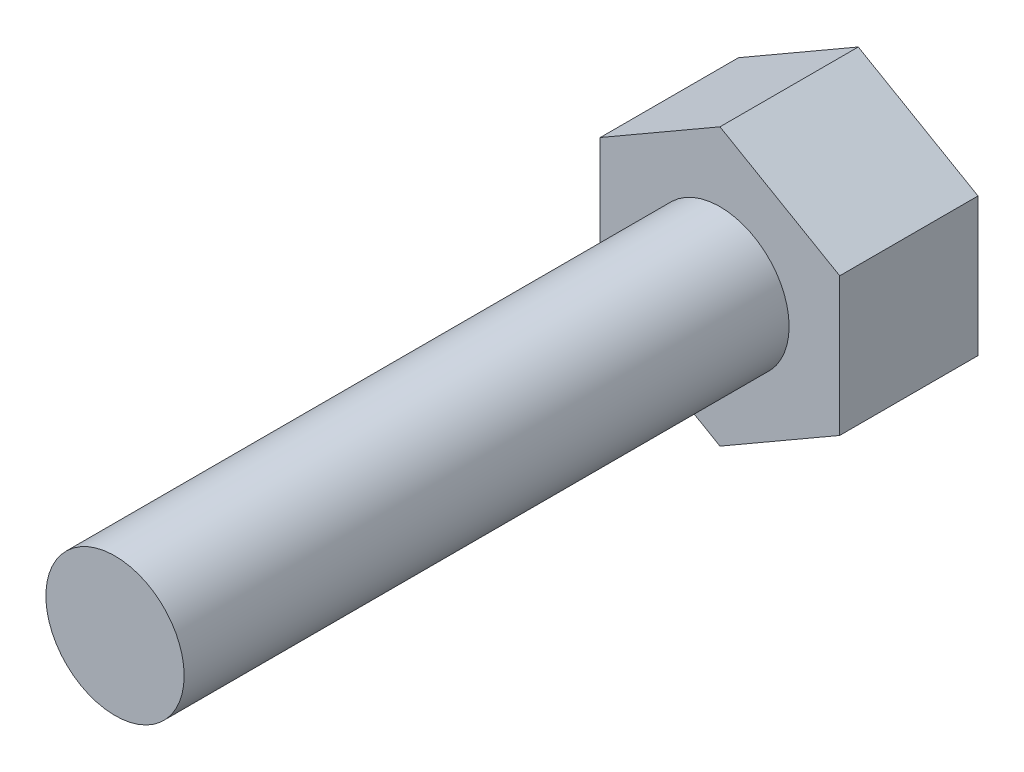
ISO-10303-21;
HEADER;
FILE_DESCRIPTION(('STEP AP214'),'2;1');
FILE_NAME('part.step','',(''),(''),'','','');
FILE_SCHEMA(('AUTOMOTIVE_DESIGN { 1 0 10303 214 1 1 1 1 }'));
ENDSEC;
DATA;
#1=APPLICATION_CONTEXT('core data for automotive mechanical design processes');
#2=APPLICATION_PROTOCOL_DEFINITION('international standard','automotive_design',2000,#1);
#3=PRODUCT_CONTEXT('',#1,'mechanical');
#4=PRODUCT('Part','Part','',(#3));
#5=PRODUCT_RELATED_PRODUCT_CATEGORY('part','',(#4));
#6=PRODUCT_DEFINITION_FORMATION('','',#4);
#7=PRODUCT_DEFINITION_CONTEXT('part definition',#1,'design');
#8=PRODUCT_DEFINITION('design','',#6,#7);
#9=PRODUCT_DEFINITION_SHAPE('','',#8);
#10=(LENGTH_UNIT() NAMED_UNIT(*) SI_UNIT(.MILLI.,.METRE.));
#11=(NAMED_UNIT(*) PLANE_ANGLE_UNIT() SI_UNIT($,.RADIAN.));
#12=(NAMED_UNIT(*) SI_UNIT($,.STERADIAN.) SOLID_ANGLE_UNIT());
#13=UNCERTAINTY_MEASURE_WITH_UNIT(LENGTH_MEASURE(1.E-05),#10,'distance_accuracy_value','');
#14=(GEOMETRIC_REPRESENTATION_CONTEXT(3) GLOBAL_UNCERTAINTY_ASSIGNED_CONTEXT((#13)) GLOBAL_UNIT_ASSIGNED_CONTEXT((#10,
#11,#12)) REPRESENTATION_CONTEXT('',''));
#15=CARTESIAN_POINT('',(0.,0.,0.));
#16=DIRECTION('',(0.,0.,1.));
#17=DIRECTION('',(1.,0.,0.));
#18=AXIS2_PLACEMENT_3D('',#15,#16,#17);
#19=CARTESIAN_POINT('',(20.7846096908264,12.0000000000002,24.));
#20=DIRECTION('',(-0.499999999999995,-0.866025403784441,0.));
#21=DIRECTION('',(0.866025403784442,-0.499999999999995,0.));
#22=AXIS2_PLACEMENT_3D('',#19,#20,#21);
#23=PLANE('',#22);
#24=DIRECTION('',(-0.866025403784442,0.499999999999995,0.));
#25=VECTOR('',#24,1.);
#26=CARTESIAN_POINT('',(20.7846096908264,12.0000000000002,0.));
#27=LINE('',#26,#25);
#28=CARTESIAN_POINT('',(20.7846096908264,12.0000000000002,0.));
#29=VERTEX_POINT('',#28);
#30=CARTESIAN_POINT('',(0.,24.,0.));
#31=VERTEX_POINT('',#30);
#32=EDGE_CURVE('E119',#29,#31,#27,.T.);
#33=ORIENTED_EDGE('',*,*,#32,.T.);
#34=DIRECTION('',(0.,0.,-1.));
#35=VECTOR('',#34,1.);
#36=CARTESIAN_POINT('',(0.,24.,24.));
#37=LINE('',#36,#35);
#38=CARTESIAN_POINT('',(0.,24.,24.));
#39=VERTEX_POINT('',#38);
#40=EDGE_CURVE('E36',#39,#31,#37,.T.);
#41=ORIENTED_EDGE('',*,*,#40,.F.);
#42=DIRECTION('',(-0.866025403784442,0.499999999999995,0.));
#43=VECTOR('',#42,1.);
#44=CARTESIAN_POINT('',(20.7846096908264,12.0000000000002,24.));
#45=LINE('',#44,#43);
#46=CARTESIAN_POINT('',(20.7846096908264,12.0000000000002,24.));
#47=VERTEX_POINT('',#46);
#48=EDGE_CURVE('E130',#47,#39,#45,.T.);
#49=ORIENTED_EDGE('',*,*,#48,.F.);
#50=DIRECTION('',(0.,0.,-1.));
#51=VECTOR('',#50,1.);
#52=CARTESIAN_POINT('',(20.7846096908264,12.0000000000002,24.));
#53=LINE('',#52,#51);
#54=EDGE_CURVE('E115',#47,#29,#53,.T.);
#55=ORIENTED_EDGE('',*,*,#54,.T.);
#56=EDGE_LOOP('',(#33,#41,#49,#55));
#57=FACE_BOUND('',#56,.T.);
#58=ADVANCED_FACE('F33',(#57),#23,.F.);
#59=CARTESIAN_POINT('',(0.,24.,24.));
#60=DIRECTION('',(0.500000000000001,-0.866025403784438,0.));
#61=DIRECTION('',(0.866025403784438,0.500000000000001,0.));
#62=AXIS2_PLACEMENT_3D('',#59,#60,#61);
#63=PLANE('',#62);
#64=DIRECTION('',(-0.866025403784438,-0.500000000000001,0.));
#65=VECTOR('',#64,1.);
#66=CARTESIAN_POINT('',(0.,24.,0.));
#67=LINE('',#66,#65);
#68=CARTESIAN_POINT('',(-20.7846096908266,12.,0.));
#69=VERTEX_POINT('',#68);
#70=EDGE_CURVE('E122',#31,#69,#67,.T.);
#71=ORIENTED_EDGE('',*,*,#70,.T.);
#72=DIRECTION('',(0.,0.,-1.));
#73=VECTOR('',#72,1.);
#74=CARTESIAN_POINT('',(-20.7846096908266,12.,24.));
#75=LINE('',#74,#73);
#76=CARTESIAN_POINT('',(-20.7846096908266,12.,24.));
#77=VERTEX_POINT('',#76);
#78=EDGE_CURVE('E133',#77,#69,#75,.T.);
#79=ORIENTED_EDGE('',*,*,#78,.F.);
#80=DIRECTION('',(-0.866025403784438,-0.500000000000001,0.));
#81=VECTOR('',#80,1.);
#82=CARTESIAN_POINT('',(0.,24.,24.));
#83=LINE('',#82,#81);
#84=EDGE_CURVE('E88',#39,#77,#83,.T.);
#85=ORIENTED_EDGE('',*,*,#84,.F.);
#86=ORIENTED_EDGE('',*,*,#40,.T.);
#87=EDGE_LOOP('',(#71,#79,#85,#86));
#88=FACE_BOUND('',#87,.T.);
#89=ADVANCED_FACE('F138',(#88),#63,.F.);
#90=CARTESIAN_POINT('',(-20.7846096908266,12.,24.));
#91=DIRECTION('',(1.,0.,0.));
#92=DIRECTION('',(0.,1.,0.));
#93=AXIS2_PLACEMENT_3D('',#90,#91,#92);
#94=PLANE('',#93);
#95=DIRECTION('',(0.,-1.,0.));
#96=VECTOR('',#95,1.);
#97=CARTESIAN_POINT('',(-20.7846096908266,12.,0.));
#98=LINE('',#97,#96);
#99=CARTESIAN_POINT('',(-20.7846096908265,-12.0000000000001,0.));
#100=VERTEX_POINT('',#99);
#101=EDGE_CURVE('E125',#69,#100,#98,.T.);
#102=ORIENTED_EDGE('',*,*,#101,.T.);
#103=DIRECTION('',(0.,0.,-1.));
#104=VECTOR('',#103,1.);
#105=CARTESIAN_POINT('',(-20.7846096908265,-12.0000000000001,24.));
#106=LINE('',#105,#104);
#107=CARTESIAN_POINT('',(-20.7846096908265,-12.0000000000001,24.));
#108=VERTEX_POINT('',#107);
#109=EDGE_CURVE('E110',#108,#100,#106,.T.);
#110=ORIENTED_EDGE('',*,*,#109,.F.);
#111=DIRECTION('',(0.,-1.,0.));
#112=VECTOR('',#111,1.);
#113=CARTESIAN_POINT('',(-20.7846096908266,12.,24.));
#114=LINE('',#113,#112);
#115=EDGE_CURVE('E101',#77,#108,#114,.T.);
#116=ORIENTED_EDGE('',*,*,#115,.F.);
#117=ORIENTED_EDGE('',*,*,#78,.T.);
#118=EDGE_LOOP('',(#102,#110,#116,#117));
#119=FACE_BOUND('',#118,.T.);
#120=ADVANCED_FACE('F144',(#119),#94,.F.);
#121=CARTESIAN_POINT('',(-20.7846096908265,-12.0000000000001,24.));
#122=DIRECTION('',(0.499999999999995,0.866025403784441,0.));
#123=DIRECTION('',(-0.866025403784441,0.499999999999995,0.));
#124=AXIS2_PLACEMENT_3D('',#121,#122,#123);
#125=PLANE('',#124);
#126=DIRECTION('',(0.866025403784441,-0.499999999999995,0.));
#127=VECTOR('',#126,1.);
#128=CARTESIAN_POINT('',(-20.7846096908265,-12.0000000000001,0.));
#129=LINE('',#128,#127);
#130=CARTESIAN_POINT('',(1.6759110426447E-13,-24.,0.));
#131=VERTEX_POINT('',#130);
#132=EDGE_CURVE('E109',#100,#131,#129,.T.);
#133=ORIENTED_EDGE('',*,*,#132,.T.);
#134=DIRECTION('',(0.,0.,-1.));
#135=VECTOR('',#134,1.);
#136=CARTESIAN_POINT('',(1.6759110426447E-13,-24.,24.));
#137=LINE('',#136,#135);
#138=CARTESIAN_POINT('',(1.6759110426447E-13,-24.,24.));
#139=VERTEX_POINT('',#138);
#140=EDGE_CURVE('E106',#139,#131,#137,.T.);
#141=ORIENTED_EDGE('',*,*,#140,.F.);
#142=DIRECTION('',(0.866025403784441,-0.499999999999995,0.));
#143=VECTOR('',#142,1.);
#144=CARTESIAN_POINT('',(-20.7846096908265,-12.0000000000001,24.));
#145=LINE('',#144,#143);
#146=EDGE_CURVE('E95',#108,#139,#145,.T.);
#147=ORIENTED_EDGE('',*,*,#146,.F.);
#148=ORIENTED_EDGE('',*,*,#109,.T.);
#149=EDGE_LOOP('',(#133,#141,#147,#148));
#150=FACE_BOUND('',#149,.T.);
#151=ADVANCED_FACE('F107',(#150),#125,.F.);
#152=CARTESIAN_POINT('',(1.6759110426447E-13,-24.,24.));
#153=DIRECTION('',(-0.500000000000007,0.866025403784435,0.));
#154=DIRECTION('',(-0.866025403784434,-0.500000000000007,0.));
#155=AXIS2_PLACEMENT_3D('',#152,#153,#154);
#156=PLANE('',#155);
#157=DIRECTION('',(0.866025403784434,0.500000000000007,0.));
#158=VECTOR('',#157,1.);
#159=CARTESIAN_POINT('',(1.6759110426447E-13,-24.,0.));
#160=LINE('',#159,#158);
#161=CARTESIAN_POINT('',(20.7846096908266,-11.9999999999998,0.));
#162=VERTEX_POINT('',#161);
#163=EDGE_CURVE('E73',#131,#162,#160,.T.);
#164=ORIENTED_EDGE('',*,*,#163,.T.);
#165=DIRECTION('',(0.,0.,-1.));
#166=VECTOR('',#165,1.);
#167=CARTESIAN_POINT('',(20.7846096908266,-11.9999999999998,24.));
#168=LINE('',#167,#166);
#169=CARTESIAN_POINT('',(20.7846096908266,-11.9999999999998,24.));
#170=VERTEX_POINT('',#169);
#171=EDGE_CURVE('E111',#170,#162,#168,.T.);
#172=ORIENTED_EDGE('',*,*,#171,.F.);
#173=DIRECTION('',(0.866025403784434,0.500000000000007,0.));
#174=VECTOR('',#173,1.);
#175=CARTESIAN_POINT('',(1.6759110426447E-13,-24.,24.));
#176=LINE('',#175,#174);
#177=EDGE_CURVE('E99',#139,#170,#176,.T.);
#178=ORIENTED_EDGE('',*,*,#177,.F.);
#179=ORIENTED_EDGE('',*,*,#140,.T.);
#180=EDGE_LOOP('',(#164,#172,#178,#179));
#181=FACE_BOUND('',#180,.T.);
#182=ADVANCED_FACE('F113',(#181),#156,.F.);
#183=CARTESIAN_POINT('',(20.7846096908266,-11.9999999999998,24.));
#184=DIRECTION('',(-1.,0.,0.));
#185=DIRECTION('',(0.,-1.,0.));
#186=AXIS2_PLACEMENT_3D('',#183,#184,#185);
#187=PLANE('',#186);
#188=DIRECTION('',(0.,1.,0.));
#189=VECTOR('',#188,1.);
#190=CARTESIAN_POINT('',(20.7846096908266,-11.9999999999998,0.));
#191=LINE('',#190,#189);
#192=EDGE_CURVE('E79',#162,#29,#191,.T.);
#193=ORIENTED_EDGE('',*,*,#192,.T.);
#194=ORIENTED_EDGE('',*,*,#54,.F.);
#195=DIRECTION('',(0.,1.,0.));
#196=VECTOR('',#195,1.);
#197=CARTESIAN_POINT('',(20.7846096908266,-11.9999999999998,24.));
#198=LINE('',#197,#196);
#199=EDGE_CURVE('E50',#170,#47,#198,.T.);
#200=ORIENTED_EDGE('',*,*,#199,.F.);
#201=ORIENTED_EDGE('',*,*,#171,.T.);
#202=EDGE_LOOP('',(#193,#194,#200,#201));
#203=FACE_BOUND('',#202,.T.);
#204=ADVANCED_FACE('F160',(#203),#187,.F.);
#205=CARTESIAN_POINT('',(0.,0.,24.));
#206=DIRECTION('',(0.,0.,1.));
#207=DIRECTION('',(1.,0.,0.));
#208=AXIS2_PLACEMENT_3D('',#205,#206,#207);
#209=PLANE('',#208);
#210=CARTESIAN_POINT('',(0.,0.,24.));
#211=DIRECTION('',(0.,0.,1.));
#212=DIRECTION('',(1.,0.,0.));
#213=AXIS2_PLACEMENT_3D('',#210,#211,#212);
#214=CIRCLE('',#213,12.);
#215=CARTESIAN_POINT('',(12.,0.,24.));
#216=VERTEX_POINT('',#215);
#217=EDGE_CURVE('E11',#216,#216,#214,.T.);
#218=ORIENTED_EDGE('',*,*,#217,.F.);
#219=EDGE_LOOP('',(#218));
#220=FACE_BOUND('',#219,.T.);
#221=ORIENTED_EDGE('',*,*,#48,.T.);
#222=ORIENTED_EDGE('',*,*,#84,.T.);
#223=ORIENTED_EDGE('',*,*,#115,.T.);
#224=ORIENTED_EDGE('',*,*,#146,.T.);
#225=ORIENTED_EDGE('',*,*,#177,.T.);
#226=ORIENTED_EDGE('',*,*,#199,.T.);
#227=EDGE_LOOP('',(#221,#222,#223,#224,#225,#226));
#228=FACE_BOUND('',#227,.T.);
#229=ADVANCED_FACE('F97',(#220,#228),#209,.T.);
#230=CARTESIAN_POINT('',(0.,0.,0.));
#231=DIRECTION('',(0.,0.,1.));
#232=DIRECTION('',(1.,0.,0.));
#233=AXIS2_PLACEMENT_3D('',#230,#231,#232);
#234=PLANE('',#233);
#235=ORIENTED_EDGE('',*,*,#32,.F.);
#236=ORIENTED_EDGE('',*,*,#192,.F.);
#237=ORIENTED_EDGE('',*,*,#163,.F.);
#238=ORIENTED_EDGE('',*,*,#132,.F.);
#239=ORIENTED_EDGE('',*,*,#101,.F.);
#240=ORIENTED_EDGE('',*,*,#70,.F.);
#241=EDGE_LOOP('',(#235,#236,#237,#238,#239,#240));
#242=FACE_BOUND('',#241,.T.);
#243=ADVANCED_FACE('F143',(#242),#234,.F.);
#244=CARTESIAN_POINT('',(0.,0.,129.));
#245=DIRECTION('',(0.,0.,-1.));
#246=DIRECTION('',(-1.,0.,0.));
#247=AXIS2_PLACEMENT_3D('',#244,#245,#246);
#248=CYLINDRICAL_SURFACE('',#247,12.);
#249=CARTESIAN_POINT('',(0.,0.,129.));
#250=DIRECTION('',(0.,0.,1.));
#251=DIRECTION('',(1.,0.,0.));
#252=AXIS2_PLACEMENT_3D('',#249,#250,#251);
#253=CIRCLE('',#252,12.);
#254=CARTESIAN_POINT('',(12.,0.,129.));
#255=VERTEX_POINT('',#254);
#256=EDGE_CURVE('E123',#255,#255,#253,.T.);
#257=ORIENTED_EDGE('',*,*,#256,.F.);
#258=EDGE_LOOP('',(#257));
#259=FACE_BOUND('',#258,.T.);
#260=ORIENTED_EDGE('',*,*,#217,.T.);
#261=EDGE_LOOP('',(#260));
#262=FACE_BOUND('',#261,.T.);
#263=ADVANCED_FACE('F153',(#259,#262),#248,.T.);
#264=CARTESIAN_POINT('',(0.,0.,129.));
#265=DIRECTION('',(0.,0.,1.));
#266=DIRECTION('',(1.,0.,0.));
#267=AXIS2_PLACEMENT_3D('',#264,#265,#266);
#268=PLANE('',#267);
#269=ORIENTED_EDGE('',*,*,#256,.T.);
#270=EDGE_LOOP('',(#269));
#271=FACE_BOUND('',#270,.T.);
#272=ADVANCED_FACE('F151',(#271),#268,.T.);
#273=CLOSED_SHELL('',(#58,#89,#120,#151,#182,#204,#229,#243,#263,#272));
#274=MANIFOLD_SOLID_BREP('B2',#273);
#275=ADVANCED_BREP_SHAPE_REPRESENTATION('',(#18,#274),#14);
#276=SHAPE_DEFINITION_REPRESENTATION(#9,#275);
ENDSEC;
END-ISO-10303-21;
